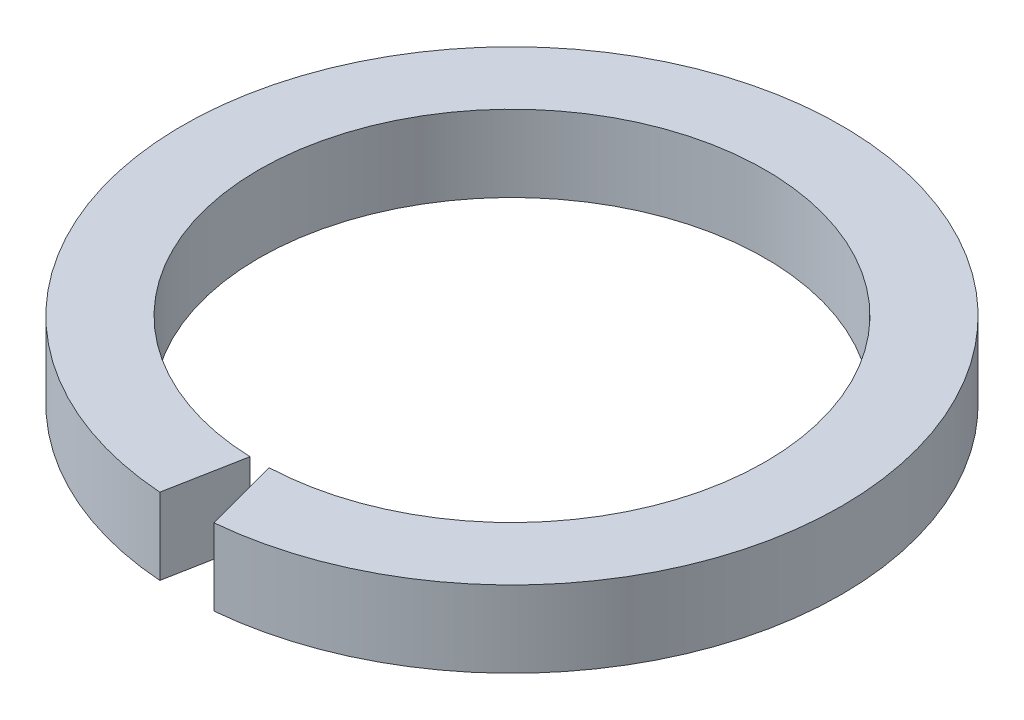
ISO-10303-21;
HEADER;
FILE_DESCRIPTION(('STEP AP214'),'2;1');
FILE_NAME('part.step','',(''),(''),'','','');
FILE_SCHEMA(('AUTOMOTIVE_DESIGN { 1 0 10303 214 1 1 1 1 }'));
ENDSEC;
DATA;
#1=APPLICATION_CONTEXT('core data for automotive mechanical design processes');
#2=APPLICATION_PROTOCOL_DEFINITION('international standard','automotive_design',2000,#1);
#3=PRODUCT_CONTEXT('',#1,'mechanical');
#4=PRODUCT('Part','Part','',(#3));
#5=PRODUCT_RELATED_PRODUCT_CATEGORY('part','',(#4));
#6=PRODUCT_DEFINITION_FORMATION('','',#4);
#7=PRODUCT_DEFINITION_CONTEXT('part definition',#1,'design');
#8=PRODUCT_DEFINITION('design','',#6,#7);
#9=PRODUCT_DEFINITION_SHAPE('','',#8);
#10=(LENGTH_UNIT() NAMED_UNIT(*) SI_UNIT(.MILLI.,.METRE.));
#11=(NAMED_UNIT(*) PLANE_ANGLE_UNIT() SI_UNIT($,.RADIAN.));
#12=(NAMED_UNIT(*) SI_UNIT($,.STERADIAN.) SOLID_ANGLE_UNIT());
#13=UNCERTAINTY_MEASURE_WITH_UNIT(LENGTH_MEASURE(1.E-05),#10,'distance_accuracy_value','');
#14=(GEOMETRIC_REPRESENTATION_CONTEXT(3) GLOBAL_UNCERTAINTY_ASSIGNED_CONTEXT((#13)) GLOBAL_UNIT_ASSIGNED_CONTEXT((#10,
#11,#12)) REPRESENTATION_CONTEXT('',''));
#15=CARTESIAN_POINT('',(0.,0.,0.));
#16=DIRECTION('',(0.,0.,1.));
#17=DIRECTION('',(1.,0.,0.));
#18=AXIS2_PLACEMENT_3D('',#15,#16,#17);
#19=CARTESIAN_POINT('',(0.,5.,0.));
#20=DIRECTION('',(0.,1.,0.));
#21=DIRECTION('',(0.,0.,1.));
#22=AXIS2_PLACEMENT_3D('',#19,#20,#21);
#23=PLANE('',#22);
#24=CARTESIAN_POINT('',(0.,5.,0.));
#25=DIRECTION('',(0.,1.,0.));
#26=DIRECTION('',(0.,0.,1.));
#27=AXIS2_PLACEMENT_3D('',#24,#25,#26);
#28=CIRCLE('',#27,21.55);
#29=CARTESIAN_POINT('',(1.97479142133946,5.,21.4593266166999));
#30=VERTEX_POINT('',#29);
#31=CARTESIAN_POINT('',(-1.53206319862282,5.,21.4954712057081));
#32=VERTEX_POINT('',#31);
#33=EDGE_CURVE('E86',#30,#32,#28,.T.);
#34=ORIENTED_EDGE('',*,*,#33,.T.);
#35=DIRECTION('',(0.186274398488076,0.,-0.982497760032004));
#36=VECTOR('',#35,1.);
#37=CARTESIAN_POINT('',(2.45507258304498,5.,0.465463828270075));
#38=LINE('',#37,#36);
#39=CARTESIAN_POINT('',(-0.592427027224346,5.,16.5393932844411));
#40=VERTEX_POINT('',#39);
#41=EDGE_CURVE('E100',#32,#40,#38,.T.);
#42=ORIENTED_EDGE('',*,*,#41,.T.);
#43=CARTESIAN_POINT('',(0.,5.,0.));
#44=DIRECTION('',(0.,1.,0.));
#45=DIRECTION('',(0.,0.,1.));
#46=AXIS2_PLACEMENT_3D('',#43,#44,#45);
#47=CIRCLE('',#46,16.55);
#48=CARTESIAN_POINT('',(0.651129953686554,5.,16.5371862716549));
#49=VERTEX_POINT('',#48);
#50=EDGE_CURVE('E96',#49,#40,#47,.T.);
#51=ORIENTED_EDGE('',*,*,#50,.F.);
#52=DIRECTION('',(0.25969354453304,0.,0.965691080484782));
#53=VECTOR('',#52,1.);
#54=CARTESIAN_POINT('',(-3.54004014623583,5.,0.951987226498703));
#55=LINE('',#54,#53);
#56=EDGE_CURVE('E63',#49,#30,#55,.T.);
#57=ORIENTED_EDGE('',*,*,#56,.T.);
#58=EDGE_LOOP('',(#34,#42,#51,#57));
#59=FACE_BOUND('',#58,.T.);
#60=ADVANCED_FACE('F41',(#59),#23,.T.);
#61=CARTESIAN_POINT('',(0.,0.,0.));
#62=DIRECTION('',(0.,1.,0.));
#63=DIRECTION('',(0.,0.,1.));
#64=AXIS2_PLACEMENT_3D('',#61,#62,#63);
#65=PLANE('',#64);
#66=DIRECTION('',(0.186274398488076,0.,-0.982497760032004));
#67=VECTOR('',#66,1.);
#68=CARTESIAN_POINT('',(2.45507258304498,0.,0.465463828270075));
#69=LINE('',#68,#67);
#70=CARTESIAN_POINT('',(-1.53206319862282,0.,21.4954712057081));
#71=VERTEX_POINT('',#70);
#72=CARTESIAN_POINT('',(-0.592427027224346,0.,16.5393932844411));
#73=VERTEX_POINT('',#72);
#74=EDGE_CURVE('E56',#71,#73,#69,.T.);
#75=ORIENTED_EDGE('',*,*,#74,.F.);
#76=CARTESIAN_POINT('',(0.,0.,0.));
#77=DIRECTION('',(0.,1.,0.));
#78=DIRECTION('',(0.,0.,1.));
#79=AXIS2_PLACEMENT_3D('',#76,#77,#78);
#80=CIRCLE('',#79,21.55);
#81=CARTESIAN_POINT('',(1.97479142133946,0.,21.4593266166999));
#82=VERTEX_POINT('',#81);
#83=EDGE_CURVE('E93',#82,#71,#80,.T.);
#84=ORIENTED_EDGE('',*,*,#83,.F.);
#85=DIRECTION('',(0.25969354453304,0.,0.965691080484782));
#86=VECTOR('',#85,1.);
#87=CARTESIAN_POINT('',(-3.54004014623583,0.,0.951987226498703));
#88=LINE('',#87,#86);
#89=CARTESIAN_POINT('',(0.651129953686554,0.,16.5371862716549));
#90=VERTEX_POINT('',#89);
#91=EDGE_CURVE('E80',#90,#82,#88,.T.);
#92=ORIENTED_EDGE('',*,*,#91,.F.);
#93=CARTESIAN_POINT('',(0.,0.,0.));
#94=DIRECTION('',(0.,1.,0.));
#95=DIRECTION('',(0.,0.,1.));
#96=AXIS2_PLACEMENT_3D('',#93,#94,#95);
#97=CIRCLE('',#96,16.55);
#98=EDGE_CURVE('E91',#90,#73,#97,.T.);
#99=ORIENTED_EDGE('',*,*,#98,.T.);
#100=EDGE_LOOP('',(#75,#84,#92,#99));
#101=FACE_BOUND('',#100,.T.);
#102=ADVANCED_FACE('F90',(#101),#65,.F.);
#103=CARTESIAN_POINT('',(0.,5.,0.));
#104=DIRECTION('',(0.,-1.,0.));
#105=DIRECTION('',(0.,0.,-1.));
#106=AXIS2_PLACEMENT_3D('',#103,#104,#105);
#107=CYLINDRICAL_SURFACE('',#106,21.55);
#108=DIRECTION('',(0.,-1.,0.));
#109=VECTOR('',#108,1.);
#110=CARTESIAN_POINT('',(-1.53206319862282,5.,21.4954712057081));
#111=LINE('',#110,#109);
#112=EDGE_CURVE('E97',#32,#71,#111,.T.);
#113=ORIENTED_EDGE('',*,*,#112,.F.);
#114=ORIENTED_EDGE('',*,*,#33,.F.);
#115=DIRECTION('',(0.,-1.,0.));
#116=VECTOR('',#115,1.);
#117=CARTESIAN_POINT('',(1.97479142133946,5.,21.4593266166999));
#118=LINE('',#117,#116);
#119=EDGE_CURVE('E108',#82,#30,#118,.F.);
#120=ORIENTED_EDGE('',*,*,#119,.F.);
#121=ORIENTED_EDGE('',*,*,#83,.T.);
#122=EDGE_LOOP('',(#113,#114,#120,#121));
#123=FACE_BOUND('',#122,.T.);
#124=ADVANCED_FACE('F43',(#123),#107,.T.);
#125=CARTESIAN_POINT('',(0.,5.,0.));
#126=DIRECTION('',(0.,-1.,0.));
#127=DIRECTION('',(0.,0.,-1.));
#128=AXIS2_PLACEMENT_3D('',#125,#126,#127);
#129=CYLINDRICAL_SURFACE('',#128,16.55);
#130=ORIENTED_EDGE('',*,*,#50,.T.);
#131=DIRECTION('',(0.,-1.,0.));
#132=VECTOR('',#131,1.);
#133=CARTESIAN_POINT('',(-0.592427027224346,5.,16.5393932844411));
#134=LINE('',#133,#132);
#135=EDGE_CURVE('E11',#40,#73,#134,.T.);
#136=ORIENTED_EDGE('',*,*,#135,.T.);
#137=ORIENTED_EDGE('',*,*,#98,.F.);
#138=DIRECTION('',(0.,-1.,0.));
#139=VECTOR('',#138,1.);
#140=CARTESIAN_POINT('',(0.651129953686554,5.,16.5371862716549));
#141=LINE('',#140,#139);
#142=EDGE_CURVE('E49',#90,#49,#141,.F.);
#143=ORIENTED_EDGE('',*,*,#142,.T.);
#144=EDGE_LOOP('',(#130,#136,#137,#143));
#145=FACE_BOUND('',#144,.T.);
#146=ADVANCED_FACE('F95',(#145),#129,.F.);
#147=CARTESIAN_POINT('',(0.504822735324526,15.,15.9931312546663));
#148=DIRECTION('',(-0.965691080484782,0.,0.25969354453304));
#149=DIRECTION('',(0.25969354453304,0.,0.965691080484782));
#150=AXIS2_PLACEMENT_3D('',#147,#148,#149);
#151=PLANE('',#150);
#152=ORIENTED_EDGE('',*,*,#119,.T.);
#153=ORIENTED_EDGE('',*,*,#56,.F.);
#154=ORIENTED_EDGE('',*,*,#142,.F.);
#155=ORIENTED_EDGE('',*,*,#91,.T.);
#156=EDGE_LOOP('',(#152,#153,#154,#155));
#157=FACE_BOUND('',#156,.T.);
#158=ADVANCED_FACE('F79',(#157),#151,.T.);
#159=CARTESIAN_POINT('',(-1.75839257455694,15.,22.6892375347882));
#160=DIRECTION('',(0.982497760032004,0.,0.186274398488076));
#161=DIRECTION('',(0.186274398488076,0.,-0.982497760032004));
#162=AXIS2_PLACEMENT_3D('',#159,#160,#161);
#163=PLANE('',#162);
#164=ORIENTED_EDGE('',*,*,#112,.T.);
#165=ORIENTED_EDGE('',*,*,#74,.T.);
#166=ORIENTED_EDGE('',*,*,#135,.F.);
#167=ORIENTED_EDGE('',*,*,#41,.F.);
#168=EDGE_LOOP('',(#164,#165,#166,#167));
#169=FACE_BOUND('',#168,.T.);
#170=ADVANCED_FACE('F115',(#169),#163,.T.);
#171=CLOSED_SHELL('',(#60,#102,#124,#146,#158,#170));
#172=MANIFOLD_SOLID_BREP('B2',#171);
#173=ADVANCED_BREP_SHAPE_REPRESENTATION('',(#18,#172),#14);
#174=SHAPE_DEFINITION_REPRESENTATION(#9,#173);
ENDSEC;
END-ISO-10303-21;
